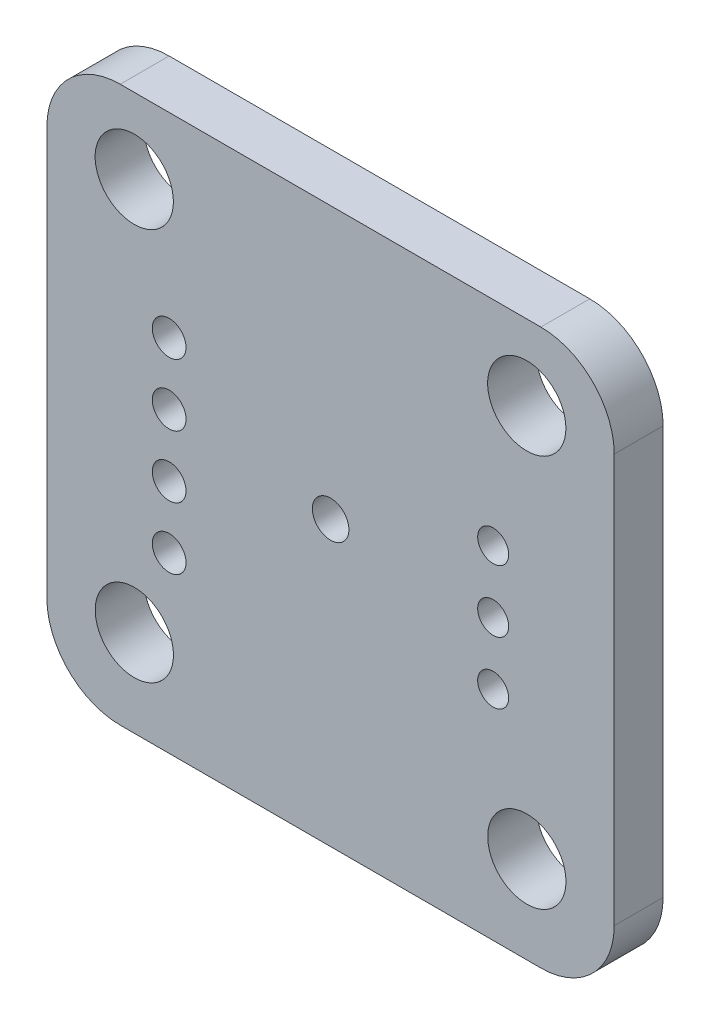
ISO-10303-21;
HEADER;
FILE_DESCRIPTION(('STEP AP214'),'2;1');
FILE_NAME('part.step','',(''),(''),'','','');
FILE_SCHEMA(('AUTOMOTIVE_DESIGN { 1 0 10303 214 1 1 1 1 }'));
ENDSEC;
DATA;
#1=APPLICATION_CONTEXT('core data for automotive mechanical design processes');
#2=APPLICATION_PROTOCOL_DEFINITION('international standard','automotive_design',2000,#1);
#3=PRODUCT_CONTEXT('',#1,'mechanical');
#4=PRODUCT('Part','Part','',(#3));
#5=PRODUCT_RELATED_PRODUCT_CATEGORY('part','',(#4));
#6=PRODUCT_DEFINITION_FORMATION('','',#4);
#7=PRODUCT_DEFINITION_CONTEXT('part definition',#1,'design');
#8=PRODUCT_DEFINITION('design','',#6,#7);
#9=PRODUCT_DEFINITION_SHAPE('','',#8);
#10=(LENGTH_UNIT() NAMED_UNIT(*) SI_UNIT(.MILLI.,.METRE.));
#11=(NAMED_UNIT(*) PLANE_ANGLE_UNIT() SI_UNIT($,.RADIAN.));
#12=(NAMED_UNIT(*) SI_UNIT($,.STERADIAN.) SOLID_ANGLE_UNIT());
#13=UNCERTAINTY_MEASURE_WITH_UNIT(LENGTH_MEASURE(1.E-05),#10,'distance_accuracy_value','');
#14=(GEOMETRIC_REPRESENTATION_CONTEXT(3) GLOBAL_UNCERTAINTY_ASSIGNED_CONTEXT((#13)) GLOBAL_UNIT_ASSIGNED_CONTEXT((#10,
#11,#12)) REPRESENTATION_CONTEXT('',''));
#15=CARTESIAN_POINT('',(0.,0.,0.));
#16=DIRECTION('',(0.,0.,1.));
#17=DIRECTION('',(1.,0.,0.));
#18=AXIS2_PLACEMENT_3D('',#15,#16,#17);
#19=CARTESIAN_POINT('',(0.,0.,2.));
#20=DIRECTION('',(0.,0.,1.));
#21=DIRECTION('',(1.,0.,0.));
#22=AXIS2_PLACEMENT_3D('',#19,#20,#21);
#23=PLANE('',#22);
#24=CARTESIAN_POINT('',(0.,0.,2.));
#25=DIRECTION('',(0.,0.,1.));
#26=DIRECTION('',(1.,0.,0.));
#27=AXIS2_PLACEMENT_3D('',#24,#25,#26);
#28=CIRCLE('',#27,0.746836087664349);
#29=CARTESIAN_POINT('',(0.746836087664349,0.,2.));
#30=VERTEX_POINT('',#29);
#31=EDGE_CURVE('E295',#30,#30,#28,.T.);
#32=ORIENTED_EDGE('',*,*,#31,.F.);
#33=EDGE_LOOP('',(#32));
#34=FACE_BOUND('',#33,.T.);
#35=CARTESIAN_POINT('',(6.64706805457635,-0.157067135375505,2.));
#36=DIRECTION('',(0.,0.,1.));
#37=DIRECTION('',(1.,0.,0.));
#38=AXIS2_PLACEMENT_3D('',#35,#36,#37);
#39=CIRCLE('',#38,0.633596252878906);
#40=CARTESIAN_POINT('',(7.28066430745526,-0.157067135375505,2.));
#41=VERTEX_POINT('',#40);
#42=EDGE_CURVE('E272',#41,#41,#39,.T.);
#43=ORIENTED_EDGE('',*,*,#42,.F.);
#44=EDGE_LOOP('',(#43));
#45=FACE_BOUND('',#44,.T.);
#46=CARTESIAN_POINT('',(6.64706805457635,2.3829328646245,2.));
#47=DIRECTION('',(0.,0.,1.));
#48=DIRECTION('',(1.,0.,0.));
#49=AXIS2_PLACEMENT_3D('',#46,#47,#48);
#50=CIRCLE('',#49,0.633596252878906);
#51=CARTESIAN_POINT('',(7.28066430745526,2.3829328646245,2.));
#52=VERTEX_POINT('',#51);
#53=EDGE_CURVE('E264',#52,#52,#50,.T.);
#54=ORIENTED_EDGE('',*,*,#53,.F.);
#55=EDGE_LOOP('',(#54));
#56=FACE_BOUND('',#55,.T.);
#57=CARTESIAN_POINT('',(-6.60293194542365,-4.49706713537551,2.));
#58=DIRECTION('',(0.,0.,1.));
#59=DIRECTION('',(1.,0.,0.));
#60=AXIS2_PLACEMENT_3D('',#57,#58,#59);
#61=CIRCLE('',#60,0.690319611344519);
#62=CARTESIAN_POINT('',(-5.91261233407913,-4.49706713537551,2.));
#63=VERTEX_POINT('',#62);
#64=EDGE_CURVE('E256',#63,#63,#61,.T.);
#65=ORIENTED_EDGE('',*,*,#64,.F.);
#66=EDGE_LOOP('',(#65));
#67=FACE_BOUND('',#66,.T.);
#68=CARTESIAN_POINT('',(-6.60293194542365,-1.95706713537551,2.));
#69=DIRECTION('',(0.,0.,1.));
#70=DIRECTION('',(1.,0.,0.));
#71=AXIS2_PLACEMENT_3D('',#68,#69,#70);
#72=CIRCLE('',#71,0.690319611344519);
#73=CARTESIAN_POINT('',(-5.91261233407913,-1.95706713537551,2.));
#74=VERTEX_POINT('',#73);
#75=EDGE_CURVE('E247',#74,#74,#72,.T.);
#76=ORIENTED_EDGE('',*,*,#75,.F.);
#77=EDGE_LOOP('',(#76));
#78=FACE_BOUND('',#77,.T.);
#79=CARTESIAN_POINT('',(-6.60293194542365,0.582932864624494,2.));
#80=DIRECTION('',(0.,0.,1.));
#81=DIRECTION('',(1.,0.,0.));
#82=AXIS2_PLACEMENT_3D('',#79,#80,#81);
#83=CIRCLE('',#82,0.690319611344519);
#84=CARTESIAN_POINT('',(-5.91261233407913,0.582932864624494,2.));
#85=VERTEX_POINT('',#84);
#86=EDGE_CURVE('E288',#85,#85,#83,.T.);
#87=ORIENTED_EDGE('',*,*,#86,.F.);
#88=EDGE_LOOP('',(#87));
#89=FACE_BOUND('',#88,.T.);
#90=CARTESIAN_POINT('',(-6.60293194542365,3.12293286462449,2.));
#91=DIRECTION('',(0.,0.,1.));
#92=DIRECTION('',(1.,0.,0.));
#93=AXIS2_PLACEMENT_3D('',#90,#91,#92);
#94=CIRCLE('',#93,0.690319611344519);
#95=CARTESIAN_POINT('',(-5.91261233407913,3.12293286462449,2.));
#96=VERTEX_POINT('',#95);
#97=EDGE_CURVE('E279',#96,#96,#94,.T.);
#98=ORIENTED_EDGE('',*,*,#97,.F.);
#99=EDGE_LOOP('',(#98));
#100=FACE_BOUND('',#99,.T.);
#101=CARTESIAN_POINT('',(6.64706805457635,-2.6970671353755,2.));
#102=DIRECTION('',(0.,0.,1.));
#103=DIRECTION('',(1.,0.,0.));
#104=AXIS2_PLACEMENT_3D('',#101,#102,#103);
#105=CIRCLE('',#104,0.633596252878906);
#106=CARTESIAN_POINT('',(7.28066430745526,-2.6970671353755,2.));
#107=VERTEX_POINT('',#106);
#108=EDGE_CURVE('E239',#107,#107,#105,.T.);
#109=ORIENTED_EDGE('',*,*,#108,.F.);
#110=EDGE_LOOP('',(#109));
#111=FACE_BOUND('',#110,.T.);
#112=CARTESIAN_POINT('',(8.02395036749889,-8.02421567539647,2.));
#113=DIRECTION('',(0.,0.,1.));
#114=DIRECTION('',(1.,0.,0.));
#115=AXIS2_PLACEMENT_3D('',#112,#113,#114);
#116=CIRCLE('',#115,1.6);
#117=CARTESIAN_POINT('',(9.62395036749889,-8.02421567539647,2.));
#118=VERTEX_POINT('',#117);
#119=EDGE_CURVE('E219',#118,#118,#116,.T.);
#120=ORIENTED_EDGE('',*,*,#119,.F.);
#121=EDGE_LOOP('',(#120));
#122=FACE_BOUND('',#121,.T.);
#123=CARTESIAN_POINT('',(-8.02981425834602,8.02421383699495,2.));
#124=DIRECTION('',(0.,0.,1.));
#125=DIRECTION('',(1.,0.,0.));
#126=AXIS2_PLACEMENT_3D('',#123,#124,#125);
#127=CIRCLE('',#126,1.6);
#128=CARTESIAN_POINT('',(-6.42981425834602,8.02421383699495,2.));
#129=VERTEX_POINT('',#128);
#130=EDGE_CURVE('E137',#129,#129,#127,.T.);
#131=ORIENTED_EDGE('',*,*,#130,.F.);
#132=EDGE_LOOP('',(#131));
#133=FACE_BOUND('',#132,.T.);
#134=DIRECTION('',(1.,0.,0.));
#135=VECTOR('',#134,1.);
#136=CARTESIAN_POINT('',(-11.6029319454236,-11.5970671353755,2.));
#137=LINE('',#136,#135);
#138=CARTESIAN_POINT('',(-8.60293194542365,-11.5970671353755,2.));
#139=VERTEX_POINT('',#138);
#140=CARTESIAN_POINT('',(8.59706805457635,-11.5970671353755,2.));
#141=VERTEX_POINT('',#140);
#142=EDGE_CURVE('E148',#139,#141,#137,.T.);
#143=ORIENTED_EDGE('',*,*,#142,.T.);
#144=CARTESIAN_POINT('',(8.59706805457635,-8.59706713537551,2.));
#145=DIRECTION('',(0.,0.,1.));
#146=DIRECTION('',(1.,0.,0.));
#147=AXIS2_PLACEMENT_3D('',#144,#145,#146);
#148=CIRCLE('',#147,3.);
#149=CARTESIAN_POINT('',(11.5970680545764,-8.59706713537551,2.));
#150=VERTEX_POINT('',#149);
#151=EDGE_CURVE('E178',#141,#150,#148,.T.);
#152=ORIENTED_EDGE('',*,*,#151,.T.);
#153=DIRECTION('',(0.,1.,0.));
#154=VECTOR('',#153,1.);
#155=CARTESIAN_POINT('',(11.5970680545764,11.1029328646245,2.));
#156=LINE('',#155,#154);
#157=CARTESIAN_POINT('',(11.5970680545764,8.10293286462449,2.));
#158=VERTEX_POINT('',#157);
#159=EDGE_CURVE('E127',#150,#158,#156,.T.);
#160=ORIENTED_EDGE('',*,*,#159,.T.);
#161=CARTESIAN_POINT('',(8.59706805457635,8.10293286462449,2.));
#162=DIRECTION('',(0.,0.,1.));
#163=DIRECTION('',(1.,0.,0.));
#164=AXIS2_PLACEMENT_3D('',#161,#162,#163);
#165=CIRCLE('',#164,3.);
#166=CARTESIAN_POINT('',(8.59706805457635,11.1029328646245,2.));
#167=VERTEX_POINT('',#166);
#168=EDGE_CURVE('E170',#158,#167,#165,.T.);
#169=ORIENTED_EDGE('',*,*,#168,.T.);
#170=DIRECTION('',(-1.,0.,0.));
#171=VECTOR('',#170,1.);
#172=CARTESIAN_POINT('',(-11.6029319454236,11.1029328646245,2.));
#173=LINE('',#172,#171);
#174=CARTESIAN_POINT('',(-8.60293194542365,11.1029328646245,2.));
#175=VERTEX_POINT('',#174);
#176=EDGE_CURVE('E193',#167,#175,#173,.T.);
#177=ORIENTED_EDGE('',*,*,#176,.T.);
#178=CARTESIAN_POINT('',(-8.60293194542365,8.10293286462449,2.));
#179=DIRECTION('',(0.,0.,1.));
#180=DIRECTION('',(1.,0.,0.));
#181=AXIS2_PLACEMENT_3D('',#178,#179,#180);
#182=CIRCLE('',#181,3.);
#183=CARTESIAN_POINT('',(-11.6029319454236,8.10293286462449,2.));
#184=VERTEX_POINT('',#183);
#185=EDGE_CURVE('E62',#175,#184,#182,.T.);
#186=ORIENTED_EDGE('',*,*,#185,.T.);
#187=DIRECTION('',(0.,-1.,0.));
#188=VECTOR('',#187,1.);
#189=CARTESIAN_POINT('',(-11.6029319454236,11.1029328646245,2.));
#190=LINE('',#189,#188);
#191=CARTESIAN_POINT('',(-11.6029319454236,-8.59706713537551,2.));
#192=VERTEX_POINT('',#191);
#193=EDGE_CURVE('E201',#184,#192,#190,.T.);
#194=ORIENTED_EDGE('',*,*,#193,.T.);
#195=CARTESIAN_POINT('',(-8.60293194542365,-8.59706713537551,2.));
#196=DIRECTION('',(0.,0.,1.));
#197=DIRECTION('',(1.,0.,0.));
#198=AXIS2_PLACEMENT_3D('',#195,#196,#197);
#199=CIRCLE('',#198,3.);
#200=EDGE_CURVE('E175',#192,#139,#199,.T.);
#201=ORIENTED_EDGE('',*,*,#200,.T.);
#202=EDGE_LOOP('',(#143,#152,#160,#169,#177,#186,#194,#201));
#203=FACE_BOUND('',#202,.T.);
#204=CARTESIAN_POINT('',(8.02128281077218,8.02688139372171,2.));
#205=DIRECTION('',(0.,0.,1.));
#206=DIRECTION('',(1.,0.,0.));
#207=AXIS2_PLACEMENT_3D('',#204,#205,#206);
#208=CIRCLE('',#207,1.6);
#209=CARTESIAN_POINT('',(9.62128281077218,8.02688139372171,2.));
#210=VERTEX_POINT('',#209);
#211=EDGE_CURVE('E213',#210,#210,#208,.T.);
#212=ORIENTED_EDGE('',*,*,#211,.F.);
#213=EDGE_LOOP('',(#212));
#214=FACE_BOUND('',#213,.T.);
#215=CARTESIAN_POINT('',(-8.0271467016193,-8.02688323212313,2.));
#216=DIRECTION('',(0.,0.,1.));
#217=DIRECTION('',(1.,0.,0.));
#218=AXIS2_PLACEMENT_3D('',#215,#216,#217);
#219=CIRCLE('',#218,1.6);
#220=CARTESIAN_POINT('',(-6.4271467016193,-8.02688323212313,2.));
#221=VERTEX_POINT('',#220);
#222=EDGE_CURVE('E227',#221,#221,#219,.T.);
#223=ORIENTED_EDGE('',*,*,#222,.F.);
#224=EDGE_LOOP('',(#223));
#225=FACE_BOUND('',#224,.T.);
#226=ADVANCED_FACE('F39',(#34,#45,#56,#67,#78,#89,#100,#111,#122,#133,#203,#214,#225),#23,.T.);
#227=CARTESIAN_POINT('',(0.,0.,0.));
#228=DIRECTION('',(0.,0.,1.));
#229=DIRECTION('',(1.,0.,0.));
#230=AXIS2_PLACEMENT_3D('',#227,#228,#229);
#231=PLANE('',#230);
#232=CARTESIAN_POINT('',(0.,0.,0.));
#233=DIRECTION('',(0.,0.,1.));
#234=DIRECTION('',(1.,0.,0.));
#235=AXIS2_PLACEMENT_3D('',#232,#233,#234);
#236=CIRCLE('',#235,0.746836087664349);
#237=CARTESIAN_POINT('',(0.746836087664349,0.,0.));
#238=VERTEX_POINT('',#237);
#239=EDGE_CURVE('E284',#238,#238,#236,.T.);
#240=ORIENTED_EDGE('',*,*,#239,.T.);
#241=EDGE_LOOP('',(#240));
#242=FACE_BOUND('',#241,.T.);
#243=CARTESIAN_POINT('',(6.64706805457635,-0.157067135375505,0.));
#244=DIRECTION('',(0.,0.,1.));
#245=DIRECTION('',(1.,0.,0.));
#246=AXIS2_PLACEMENT_3D('',#243,#244,#245);
#247=CIRCLE('',#246,0.633596252878906);
#248=CARTESIAN_POINT('',(7.28066430745526,-0.157067135375505,0.));
#249=VERTEX_POINT('',#248);
#250=EDGE_CURVE('E243',#249,#249,#247,.T.);
#251=ORIENTED_EDGE('',*,*,#250,.T.);
#252=EDGE_LOOP('',(#251));
#253=FACE_BOUND('',#252,.T.);
#254=CARTESIAN_POINT('',(6.64706805457635,2.3829328646245,0.));
#255=DIRECTION('',(0.,0.,1.));
#256=DIRECTION('',(1.,0.,0.));
#257=AXIS2_PLACEMENT_3D('',#254,#255,#256);
#258=CIRCLE('',#257,0.633596252878906);
#259=CARTESIAN_POINT('',(7.28066430745526,2.3829328646245,0.));
#260=VERTEX_POINT('',#259);
#261=EDGE_CURVE('E268',#260,#260,#258,.T.);
#262=ORIENTED_EDGE('',*,*,#261,.T.);
#263=EDGE_LOOP('',(#262));
#264=FACE_BOUND('',#263,.T.);
#265=CARTESIAN_POINT('',(-6.60293194542365,-4.49706713537551,0.));
#266=DIRECTION('',(0.,0.,1.));
#267=DIRECTION('',(1.,0.,0.));
#268=AXIS2_PLACEMENT_3D('',#265,#266,#267);
#269=CIRCLE('',#268,0.690319611344519);
#270=CARTESIAN_POINT('',(-5.91261233407913,-4.49706713537551,0.));
#271=VERTEX_POINT('',#270);
#272=EDGE_CURVE('E260',#271,#271,#269,.T.);
#273=ORIENTED_EDGE('',*,*,#272,.T.);
#274=EDGE_LOOP('',(#273));
#275=FACE_BOUND('',#274,.T.);
#276=CARTESIAN_POINT('',(-6.60293194542365,-1.95706713537551,0.));
#277=DIRECTION('',(0.,0.,1.));
#278=DIRECTION('',(1.,0.,0.));
#279=AXIS2_PLACEMENT_3D('',#276,#277,#278);
#280=CIRCLE('',#279,0.690319611344519);
#281=CARTESIAN_POINT('',(-5.91261233407913,-1.95706713537551,0.));
#282=VERTEX_POINT('',#281);
#283=EDGE_CURVE('E251',#282,#282,#280,.T.);
#284=ORIENTED_EDGE('',*,*,#283,.T.);
#285=EDGE_LOOP('',(#284));
#286=FACE_BOUND('',#285,.T.);
#287=CARTESIAN_POINT('',(-6.60293194542365,0.582932864624494,0.));
#288=DIRECTION('',(0.,0.,1.));
#289=DIRECTION('',(1.,0.,0.));
#290=AXIS2_PLACEMENT_3D('',#287,#288,#289);
#291=CIRCLE('',#290,0.690319611344519);
#292=CARTESIAN_POINT('',(-5.91261233407913,0.582932864624494,0.));
#293=VERTEX_POINT('',#292);
#294=EDGE_CURVE('E252',#293,#293,#291,.T.);
#295=ORIENTED_EDGE('',*,*,#294,.T.);
#296=EDGE_LOOP('',(#295));
#297=FACE_BOUND('',#296,.T.);
#298=CARTESIAN_POINT('',(-6.60293194542365,3.12293286462449,0.));
#299=DIRECTION('',(0.,0.,1.));
#300=DIRECTION('',(1.,0.,0.));
#301=AXIS2_PLACEMENT_3D('',#298,#299,#300);
#302=CIRCLE('',#301,0.690319611344519);
#303=CARTESIAN_POINT('',(-5.91261233407913,3.12293286462449,0.));
#304=VERTEX_POINT('',#303);
#305=EDGE_CURVE('E283',#304,#304,#302,.T.);
#306=ORIENTED_EDGE('',*,*,#305,.T.);
#307=EDGE_LOOP('',(#306));
#308=FACE_BOUND('',#307,.T.);
#309=CARTESIAN_POINT('',(6.64706805457635,-2.6970671353755,0.));
#310=DIRECTION('',(0.,0.,1.));
#311=DIRECTION('',(1.,0.,0.));
#312=AXIS2_PLACEMENT_3D('',#309,#310,#311);
#313=CIRCLE('',#312,0.633596252878906);
#314=CARTESIAN_POINT('',(7.28066430745526,-2.6970671353755,0.));
#315=VERTEX_POINT('',#314);
#316=EDGE_CURVE('E235',#315,#315,#313,.T.);
#317=ORIENTED_EDGE('',*,*,#316,.T.);
#318=EDGE_LOOP('',(#317));
#319=FACE_BOUND('',#318,.T.);
#320=DIRECTION('',(0.,1.,0.));
#321=VECTOR('',#320,1.);
#322=CARTESIAN_POINT('',(11.5970680545764,11.1029328646245,0.));
#323=LINE('',#322,#321);
#324=CARTESIAN_POINT('',(11.5970680545764,-8.59706713537551,0.));
#325=VERTEX_POINT('',#324);
#326=CARTESIAN_POINT('',(11.5970680545764,8.10293286462449,0.));
#327=VERTEX_POINT('',#326);
#328=EDGE_CURVE('E124',#325,#327,#323,.T.);
#329=ORIENTED_EDGE('',*,*,#328,.F.);
#330=CARTESIAN_POINT('',(8.59706805457635,-8.59706713537551,0.));
#331=DIRECTION('',(0.,0.,1.));
#332=DIRECTION('',(1.,0.,0.));
#333=AXIS2_PLACEMENT_3D('',#330,#331,#332);
#334=CIRCLE('',#333,3.);
#335=CARTESIAN_POINT('',(8.59706805457635,-11.5970671353755,0.));
#336=VERTEX_POINT('',#335);
#337=EDGE_CURVE('E106',#325,#336,#334,.F.);
#338=ORIENTED_EDGE('',*,*,#337,.T.);
#339=DIRECTION('',(1.,0.,0.));
#340=VECTOR('',#339,1.);
#341=CARTESIAN_POINT('',(-11.6029319454236,-11.5970671353755,0.));
#342=LINE('',#341,#340);
#343=CARTESIAN_POINT('',(-8.60293194542365,-11.5970671353755,0.));
#344=VERTEX_POINT('',#343);
#345=EDGE_CURVE('E153',#344,#336,#342,.T.);
#346=ORIENTED_EDGE('',*,*,#345,.F.);
#347=CARTESIAN_POINT('',(-8.60293194542365,-8.59706713537551,0.));
#348=DIRECTION('',(0.,0.,1.));
#349=DIRECTION('',(1.,0.,0.));
#350=AXIS2_PLACEMENT_3D('',#347,#348,#349);
#351=CIRCLE('',#350,3.);
#352=CARTESIAN_POINT('',(-11.6029319454236,-8.59706713537551,0.));
#353=VERTEX_POINT('',#352);
#354=EDGE_CURVE('E118',#344,#353,#351,.F.);
#355=ORIENTED_EDGE('',*,*,#354,.T.);
#356=DIRECTION('',(0.,-1.,0.));
#357=VECTOR('',#356,1.);
#358=CARTESIAN_POINT('',(-11.6029319454236,11.1029328646245,0.));
#359=LINE('',#358,#357);
#360=CARTESIAN_POINT('',(-11.6029319454236,8.10293286462449,0.));
#361=VERTEX_POINT('',#360);
#362=EDGE_CURVE('E142',#361,#353,#359,.T.);
#363=ORIENTED_EDGE('',*,*,#362,.F.);
#364=CARTESIAN_POINT('',(-8.60293194542365,8.10293286462449,0.));
#365=DIRECTION('',(0.,0.,1.));
#366=DIRECTION('',(1.,0.,0.));
#367=AXIS2_PLACEMENT_3D('',#364,#365,#366);
#368=CIRCLE('',#367,3.);
#369=CARTESIAN_POINT('',(-8.60293194542365,11.1029328646245,0.));
#370=VERTEX_POINT('',#369);
#371=EDGE_CURVE('E160',#361,#370,#368,.F.);
#372=ORIENTED_EDGE('',*,*,#371,.T.);
#373=DIRECTION('',(-1.,0.,0.));
#374=VECTOR('',#373,1.);
#375=CARTESIAN_POINT('',(-11.6029319454236,11.1029328646245,0.));
#376=LINE('',#375,#374);
#377=CARTESIAN_POINT('',(8.59706805457635,11.1029328646245,0.));
#378=VERTEX_POINT('',#377);
#379=EDGE_CURVE('E136',#378,#370,#376,.T.);
#380=ORIENTED_EDGE('',*,*,#379,.F.);
#381=CARTESIAN_POINT('',(8.59706805457635,8.10293286462449,0.));
#382=DIRECTION('',(0.,0.,1.));
#383=DIRECTION('',(1.,0.,0.));
#384=AXIS2_PLACEMENT_3D('',#381,#382,#383);
#385=CIRCLE('',#384,3.);
#386=EDGE_CURVE('E129',#378,#327,#385,.F.);
#387=ORIENTED_EDGE('',*,*,#386,.T.);
#388=EDGE_LOOP('',(#329,#338,#346,#355,#363,#372,#380,#387));
#389=FACE_BOUND('',#388,.T.);
#390=CARTESIAN_POINT('',(-8.02981425834602,8.02421383699495,0.));
#391=DIRECTION('',(0.,0.,1.));
#392=DIRECTION('',(1.,0.,0.));
#393=AXIS2_PLACEMENT_3D('',#390,#391,#392);
#394=CIRCLE('',#393,1.6);
#395=CARTESIAN_POINT('',(-6.42981425834602,8.02421383699495,0.));
#396=VERTEX_POINT('',#395);
#397=EDGE_CURVE('E145',#396,#396,#394,.T.);
#398=ORIENTED_EDGE('',*,*,#397,.T.);
#399=EDGE_LOOP('',(#398));
#400=FACE_BOUND('',#399,.T.);
#401=CARTESIAN_POINT('',(8.02128281077218,8.02688139372171,0.));
#402=DIRECTION('',(0.,0.,1.));
#403=DIRECTION('',(1.,0.,0.));
#404=AXIS2_PLACEMENT_3D('',#401,#402,#403);
#405=CIRCLE('',#404,1.6);
#406=CARTESIAN_POINT('',(9.62128281077218,8.02688139372171,0.));
#407=VERTEX_POINT('',#406);
#408=EDGE_CURVE('E215',#407,#407,#405,.T.);
#409=ORIENTED_EDGE('',*,*,#408,.T.);
#410=EDGE_LOOP('',(#409));
#411=FACE_BOUND('',#410,.T.);
#412=CARTESIAN_POINT('',(8.02395036749889,-8.02421567539647,0.));
#413=DIRECTION('',(0.,0.,1.));
#414=DIRECTION('',(1.,0.,0.));
#415=AXIS2_PLACEMENT_3D('',#412,#413,#414);
#416=CIRCLE('',#415,1.6);
#417=CARTESIAN_POINT('',(9.62395036749889,-8.02421567539647,0.));
#418=VERTEX_POINT('',#417);
#419=EDGE_CURVE('E223',#418,#418,#416,.T.);
#420=ORIENTED_EDGE('',*,*,#419,.T.);
#421=EDGE_LOOP('',(#420));
#422=FACE_BOUND('',#421,.T.);
#423=CARTESIAN_POINT('',(-8.0271467016193,-8.02688323212313,0.));
#424=DIRECTION('',(0.,0.,1.));
#425=DIRECTION('',(1.,0.,0.));
#426=AXIS2_PLACEMENT_3D('',#423,#424,#425);
#427=CIRCLE('',#426,1.6);
#428=CARTESIAN_POINT('',(-6.4271467016193,-8.02688323212313,0.));
#429=VERTEX_POINT('',#428);
#430=EDGE_CURVE('E231',#429,#429,#427,.T.);
#431=ORIENTED_EDGE('',*,*,#430,.T.);
#432=EDGE_LOOP('',(#431));
#433=FACE_BOUND('',#432,.T.);
#434=ADVANCED_FACE('F132',(#242,#253,#264,#275,#286,#297,#308,#319,#389,#400,#411,#422,#433),
#231,.F.);
#435=CARTESIAN_POINT('',(11.5970680545764,11.1029328646245,2.));
#436=DIRECTION('',(-1.,0.,0.));
#437=DIRECTION('',(0.,0.,1.));
#438=AXIS2_PLACEMENT_3D('',#435,#436,#437);
#439=PLANE('',#438);
#440=ORIENTED_EDGE('',*,*,#159,.F.);
#441=DIRECTION('',(0.,0.,-1.));
#442=VECTOR('',#441,1.);
#443=CARTESIAN_POINT('',(11.5970680545764,-8.59706713537551,2.));
#444=LINE('',#443,#442);
#445=EDGE_CURVE('E110',#150,#325,#444,.T.);
#446=ORIENTED_EDGE('',*,*,#445,.T.);
#447=ORIENTED_EDGE('',*,*,#328,.T.);
#448=DIRECTION('',(0.,0.,-1.));
#449=VECTOR('',#448,1.);
#450=CARTESIAN_POINT('',(11.5970680545764,8.10293286462449,2.));
#451=LINE('',#450,#449);
#452=EDGE_CURVE('E130',#327,#158,#451,.F.);
#453=ORIENTED_EDGE('',*,*,#452,.T.);
#454=EDGE_LOOP('',(#440,#446,#447,#453));
#455=FACE_BOUND('',#454,.T.);
#456=ADVANCED_FACE('F123',(#455),#439,.F.);
#457=CARTESIAN_POINT('',(-11.6029319454236,11.1029328646245,2.));
#458=DIRECTION('',(0.,-1.,0.));
#459=DIRECTION('',(0.,0.,-1.));
#460=AXIS2_PLACEMENT_3D('',#457,#458,#459);
#461=PLANE('',#460);
#462=ORIENTED_EDGE('',*,*,#379,.T.);
#463=DIRECTION('',(0.,0.,-1.));
#464=VECTOR('',#463,1.);
#465=CARTESIAN_POINT('',(-8.60293194542365,11.1029328646245,2.));
#466=LINE('',#465,#464);
#467=EDGE_CURVE('E11',#370,#175,#466,.F.);
#468=ORIENTED_EDGE('',*,*,#467,.T.);
#469=ORIENTED_EDGE('',*,*,#176,.F.);
#470=DIRECTION('',(0.,0.,-1.));
#471=VECTOR('',#470,1.);
#472=CARTESIAN_POINT('',(8.59706805457635,11.1029328646245,2.));
#473=LINE('',#472,#471);
#474=EDGE_CURVE('E48',#167,#378,#473,.T.);
#475=ORIENTED_EDGE('',*,*,#474,.T.);
#476=EDGE_LOOP('',(#462,#468,#469,#475));
#477=FACE_BOUND('',#476,.T.);
#478=ADVANCED_FACE('F191',(#477),#461,.F.);
#479=CARTESIAN_POINT('',(-11.6029319454236,11.1029328646245,2.));
#480=DIRECTION('',(1.,0.,0.));
#481=DIRECTION('',(0.,0.,-1.));
#482=AXIS2_PLACEMENT_3D('',#479,#480,#481);
#483=PLANE('',#482);
#484=ORIENTED_EDGE('',*,*,#362,.T.);
#485=DIRECTION('',(0.,0.,-1.));
#486=VECTOR('',#485,1.);
#487=CARTESIAN_POINT('',(-11.6029319454236,-8.59706713537551,2.));
#488=LINE('',#487,#486);
#489=EDGE_CURVE('E55',#353,#192,#488,.F.);
#490=ORIENTED_EDGE('',*,*,#489,.T.);
#491=ORIENTED_EDGE('',*,*,#193,.F.);
#492=DIRECTION('',(0.,0.,-1.));
#493=VECTOR('',#492,1.);
#494=CARTESIAN_POINT('',(-11.6029319454236,8.10293286462449,2.));
#495=LINE('',#494,#493);
#496=EDGE_CURVE('E181',#184,#361,#495,.T.);
#497=ORIENTED_EDGE('',*,*,#496,.T.);
#498=EDGE_LOOP('',(#484,#490,#491,#497));
#499=FACE_BOUND('',#498,.T.);
#500=ADVANCED_FACE('F200',(#499),#483,.F.);
#501=CARTESIAN_POINT('',(-11.6029319454236,-11.5970671353755,2.));
#502=DIRECTION('',(0.,1.,0.));
#503=DIRECTION('',(0.,0.,1.));
#504=AXIS2_PLACEMENT_3D('',#501,#502,#503);
#505=PLANE('',#504);
#506=ORIENTED_EDGE('',*,*,#345,.T.);
#507=DIRECTION('',(0.,0.,-1.));
#508=VECTOR('',#507,1.);
#509=CARTESIAN_POINT('',(8.59706805457635,-11.5970671353755,2.));
#510=LINE('',#509,#508);
#511=EDGE_CURVE('E111',#336,#141,#510,.F.);
#512=ORIENTED_EDGE('',*,*,#511,.T.);
#513=ORIENTED_EDGE('',*,*,#142,.F.);
#514=DIRECTION('',(0.,0.,-1.));
#515=VECTOR('',#514,1.);
#516=CARTESIAN_POINT('',(-8.60293194542365,-11.5970671353755,2.));
#517=LINE('',#516,#515);
#518=EDGE_CURVE('E117',#139,#344,#517,.T.);
#519=ORIENTED_EDGE('',*,*,#518,.T.);
#520=EDGE_LOOP('',(#506,#512,#513,#519));
#521=FACE_BOUND('',#520,.T.);
#522=ADVANCED_FACE('F354',(#521),#505,.F.);
#523=CARTESIAN_POINT('',(-8.02981425834602,8.02421383699495,2.));
#524=DIRECTION('',(0.,0.,-1.));
#525=DIRECTION('',(-1.,0.,0.));
#526=AXIS2_PLACEMENT_3D('',#523,#524,#525);
#527=CYLINDRICAL_SURFACE('',#526,1.6);
#528=ORIENTED_EDGE('',*,*,#130,.T.);
#529=EDGE_LOOP('',(#528));
#530=FACE_BOUND('',#529,.T.);
#531=ORIENTED_EDGE('',*,*,#397,.F.);
#532=EDGE_LOOP('',(#531));
#533=FACE_BOUND('',#532,.T.);
#534=ADVANCED_FACE('F357',(#530,#533),#527,.F.);
#535=CARTESIAN_POINT('',(8.02128281077218,8.02688139372171,2.));
#536=DIRECTION('',(0.,0.,-1.));
#537=DIRECTION('',(-1.,0.,0.));
#538=AXIS2_PLACEMENT_3D('',#535,#536,#537);
#539=CYLINDRICAL_SURFACE('',#538,1.6);
#540=ORIENTED_EDGE('',*,*,#211,.T.);
#541=EDGE_LOOP('',(#540));
#542=FACE_BOUND('',#541,.T.);
#543=ORIENTED_EDGE('',*,*,#408,.F.);
#544=EDGE_LOOP('',(#543));
#545=FACE_BOUND('',#544,.T.);
#546=ADVANCED_FACE('F393',(#542,#545),#539,.F.);
#547=CARTESIAN_POINT('',(8.02395036749889,-8.02421567539647,2.));
#548=DIRECTION('',(0.,0.,-1.));
#549=DIRECTION('',(-1.,0.,0.));
#550=AXIS2_PLACEMENT_3D('',#547,#548,#549);
#551=CYLINDRICAL_SURFACE('',#550,1.6);
#552=ORIENTED_EDGE('',*,*,#119,.T.);
#553=EDGE_LOOP('',(#552));
#554=FACE_BOUND('',#553,.T.);
#555=ORIENTED_EDGE('',*,*,#419,.F.);
#556=EDGE_LOOP('',(#555));
#557=FACE_BOUND('',#556,.T.);
#558=ADVANCED_FACE('F341',(#554,#557),#551,.F.);
#559=CARTESIAN_POINT('',(-8.0271467016193,-8.02688323212313,2.));
#560=DIRECTION('',(0.,0.,-1.));
#561=DIRECTION('',(-1.,0.,0.));
#562=AXIS2_PLACEMENT_3D('',#559,#560,#561);
#563=CYLINDRICAL_SURFACE('',#562,1.6);
#564=ORIENTED_EDGE('',*,*,#222,.T.);
#565=EDGE_LOOP('',(#564));
#566=FACE_BOUND('',#565,.T.);
#567=ORIENTED_EDGE('',*,*,#430,.F.);
#568=EDGE_LOOP('',(#567));
#569=FACE_BOUND('',#568,.T.);
#570=ADVANCED_FACE('F338',(#566,#569),#563,.F.);
#571=CARTESIAN_POINT('',(8.59706805457635,-8.59706713537551,2.));
#572=DIRECTION('',(0.,0.,-1.));
#573=DIRECTION('',(-1.,0.,0.));
#574=AXIS2_PLACEMENT_3D('',#571,#572,#573);
#575=CYLINDRICAL_SURFACE('',#574,3.);
#576=ORIENTED_EDGE('',*,*,#151,.F.);
#577=ORIENTED_EDGE('',*,*,#511,.F.);
#578=ORIENTED_EDGE('',*,*,#337,.F.);
#579=ORIENTED_EDGE('',*,*,#445,.F.);
#580=EDGE_LOOP('',(#576,#577,#578,#579));
#581=FACE_BOUND('',#580,.T.);
#582=ADVANCED_FACE('F109',(#581),#575,.T.);
#583=CARTESIAN_POINT('',(-8.60293194542365,-8.59706713537551,2.));
#584=DIRECTION('',(0.,0.,-1.));
#585=DIRECTION('',(-1.,0.,0.));
#586=AXIS2_PLACEMENT_3D('',#583,#584,#585);
#587=CYLINDRICAL_SURFACE('',#586,3.);
#588=ORIENTED_EDGE('',*,*,#200,.F.);
#589=ORIENTED_EDGE('',*,*,#489,.F.);
#590=ORIENTED_EDGE('',*,*,#354,.F.);
#591=ORIENTED_EDGE('',*,*,#518,.F.);
#592=EDGE_LOOP('',(#588,#589,#590,#591));
#593=FACE_BOUND('',#592,.T.);
#594=ADVANCED_FACE('F365',(#593),#587,.T.);
#595=CARTESIAN_POINT('',(-8.60293194542365,8.10293286462449,2.));
#596=DIRECTION('',(0.,0.,-1.));
#597=DIRECTION('',(-1.,0.,0.));
#598=AXIS2_PLACEMENT_3D('',#595,#596,#597);
#599=CYLINDRICAL_SURFACE('',#598,3.);
#600=ORIENTED_EDGE('',*,*,#185,.F.);
#601=ORIENTED_EDGE('',*,*,#467,.F.);
#602=ORIENTED_EDGE('',*,*,#371,.F.);
#603=ORIENTED_EDGE('',*,*,#496,.F.);
#604=EDGE_LOOP('',(#600,#601,#602,#603));
#605=FACE_BOUND('',#604,.T.);
#606=ADVANCED_FACE('F199',(#605),#599,.T.);
#607=CARTESIAN_POINT('',(8.59706805457635,8.10293286462449,2.));
#608=DIRECTION('',(0.,0.,-1.));
#609=DIRECTION('',(-1.,0.,0.));
#610=AXIS2_PLACEMENT_3D('',#607,#608,#609);
#611=CYLINDRICAL_SURFACE('',#610,3.);
#612=ORIENTED_EDGE('',*,*,#168,.F.);
#613=ORIENTED_EDGE('',*,*,#452,.F.);
#614=ORIENTED_EDGE('',*,*,#386,.F.);
#615=ORIENTED_EDGE('',*,*,#474,.F.);
#616=EDGE_LOOP('',(#612,#613,#614,#615));
#617=FACE_BOUND('',#616,.T.);
#618=ADVANCED_FACE('F41',(#617),#611,.T.);
#619=CARTESIAN_POINT('',(6.64706805457635,-2.6970671353755,0.));
#620=DIRECTION('',(0.,0.,1.));
#621=DIRECTION('',(1.,0.,0.));
#622=AXIS2_PLACEMENT_3D('',#619,#620,#621);
#623=CYLINDRICAL_SURFACE('',#622,0.633596252878906);
#624=ORIENTED_EDGE('',*,*,#316,.F.);
#625=EDGE_LOOP('',(#624));
#626=FACE_BOUND('',#625,.T.);
#627=ORIENTED_EDGE('',*,*,#108,.T.);
#628=EDGE_LOOP('',(#627));
#629=FACE_BOUND('',#628,.T.);
#630=ADVANCED_FACE('F372',(#626,#629),#623,.F.);
#631=CARTESIAN_POINT('',(-6.60293194542365,3.12293286462449,0.));
#632=DIRECTION('',(0.,0.,1.));
#633=DIRECTION('',(1.,0.,0.));
#634=AXIS2_PLACEMENT_3D('',#631,#632,#633);
#635=CYLINDRICAL_SURFACE('',#634,0.690319611344519);
#636=ORIENTED_EDGE('',*,*,#305,.F.);
#637=EDGE_LOOP('',(#636));
#638=FACE_BOUND('',#637,.T.);
#639=ORIENTED_EDGE('',*,*,#97,.T.);
#640=EDGE_LOOP('',(#639));
#641=FACE_BOUND('',#640,.T.);
#642=ADVANCED_FACE('F376',(#638,#641),#635,.F.);
#643=CARTESIAN_POINT('',(-6.60293194542365,0.582932864624494,0.));
#644=DIRECTION('',(0.,0.,1.));
#645=DIRECTION('',(1.,0.,0.));
#646=AXIS2_PLACEMENT_3D('',#643,#644,#645);
#647=CYLINDRICAL_SURFACE('',#646,0.690319611344519);
#648=ORIENTED_EDGE('',*,*,#294,.F.);
#649=EDGE_LOOP('',(#648));
#650=FACE_BOUND('',#649,.T.);
#651=ORIENTED_EDGE('',*,*,#86,.T.);
#652=EDGE_LOOP('',(#651));
#653=FACE_BOUND('',#652,.T.);
#654=ADVANCED_FACE('F382',(#650,#653),#647,.F.);
#655=CARTESIAN_POINT('',(-6.60293194542365,-1.95706713537551,0.));
#656=DIRECTION('',(0.,0.,1.));
#657=DIRECTION('',(1.,0.,0.));
#658=AXIS2_PLACEMENT_3D('',#655,#656,#657);
#659=CYLINDRICAL_SURFACE('',#658,0.690319611344519);
#660=ORIENTED_EDGE('',*,*,#283,.F.);
#661=EDGE_LOOP('',(#660));
#662=FACE_BOUND('',#661,.T.);
#663=ORIENTED_EDGE('',*,*,#75,.T.);
#664=EDGE_LOOP('',(#663));
#665=FACE_BOUND('',#664,.T.);
#666=ADVANCED_FACE('F388',(#662,#665),#659,.F.);
#667=CARTESIAN_POINT('',(-6.60293194542365,-4.49706713537551,0.));
#668=DIRECTION('',(0.,0.,1.));
#669=DIRECTION('',(1.,0.,0.));
#670=AXIS2_PLACEMENT_3D('',#667,#668,#669);
#671=CYLINDRICAL_SURFACE('',#670,0.690319611344519);
#672=ORIENTED_EDGE('',*,*,#272,.F.);
#673=EDGE_LOOP('',(#672));
#674=FACE_BOUND('',#673,.T.);
#675=ORIENTED_EDGE('',*,*,#64,.T.);
#676=EDGE_LOOP('',(#675));
#677=FACE_BOUND('',#676,.T.);
#678=ADVANCED_FACE('F468',(#674,#677),#671,.F.);
#679=CARTESIAN_POINT('',(6.64706805457635,2.3829328646245,0.));
#680=DIRECTION('',(0.,0.,1.));
#681=DIRECTION('',(1.,0.,0.));
#682=AXIS2_PLACEMENT_3D('',#679,#680,#681);
#683=CYLINDRICAL_SURFACE('',#682,0.633596252878906);
#684=ORIENTED_EDGE('',*,*,#261,.F.);
#685=EDGE_LOOP('',(#684));
#686=FACE_BOUND('',#685,.T.);
#687=ORIENTED_EDGE('',*,*,#53,.T.);
#688=EDGE_LOOP('',(#687));
#689=FACE_BOUND('',#688,.T.);
#690=ADVANCED_FACE('F477',(#686,#689),#683,.F.);
#691=CARTESIAN_POINT('',(6.64706805457635,-0.157067135375505,0.));
#692=DIRECTION('',(0.,0.,1.));
#693=DIRECTION('',(1.,0.,0.));
#694=AXIS2_PLACEMENT_3D('',#691,#692,#693);
#695=CYLINDRICAL_SURFACE('',#694,0.633596252878906);
#696=ORIENTED_EDGE('',*,*,#250,.F.);
#697=EDGE_LOOP('',(#696));
#698=FACE_BOUND('',#697,.T.);
#699=ORIENTED_EDGE('',*,*,#42,.T.);
#700=EDGE_LOOP('',(#699));
#701=FACE_BOUND('',#700,.T.);
#702=ADVANCED_FACE('F308',(#698,#701),#695,.F.);
#703=CARTESIAN_POINT('',(0.,0.,0.));
#704=DIRECTION('',(0.,0.,1.));
#705=DIRECTION('',(1.,0.,0.));
#706=AXIS2_PLACEMENT_3D('',#703,#704,#705);
#707=CYLINDRICAL_SURFACE('',#706,0.746836087664349);
#708=ORIENTED_EDGE('',*,*,#239,.F.);
#709=EDGE_LOOP('',(#708));
#710=FACE_BOUND('',#709,.T.);
#711=ORIENTED_EDGE('',*,*,#31,.T.);
#712=EDGE_LOOP('',(#711));
#713=FACE_BOUND('',#712,.T.);
#714=ADVANCED_FACE('F305',(#710,#713),#707,.F.);
#715=CLOSED_SHELL('',(#226,#434,#456,#478,#500,#522,#534,#546,#558,#570,#582,#594,#606,#618,
#630,#642,#654,#666,#678,#690,#702,#714));
#716=MANIFOLD_SOLID_BREP('B2',#715);
#717=ADVANCED_BREP_SHAPE_REPRESENTATION('',(#18,#716),#14);
#718=SHAPE_DEFINITION_REPRESENTATION(#9,#717);
ENDSEC;
END-ISO-10303-21;
